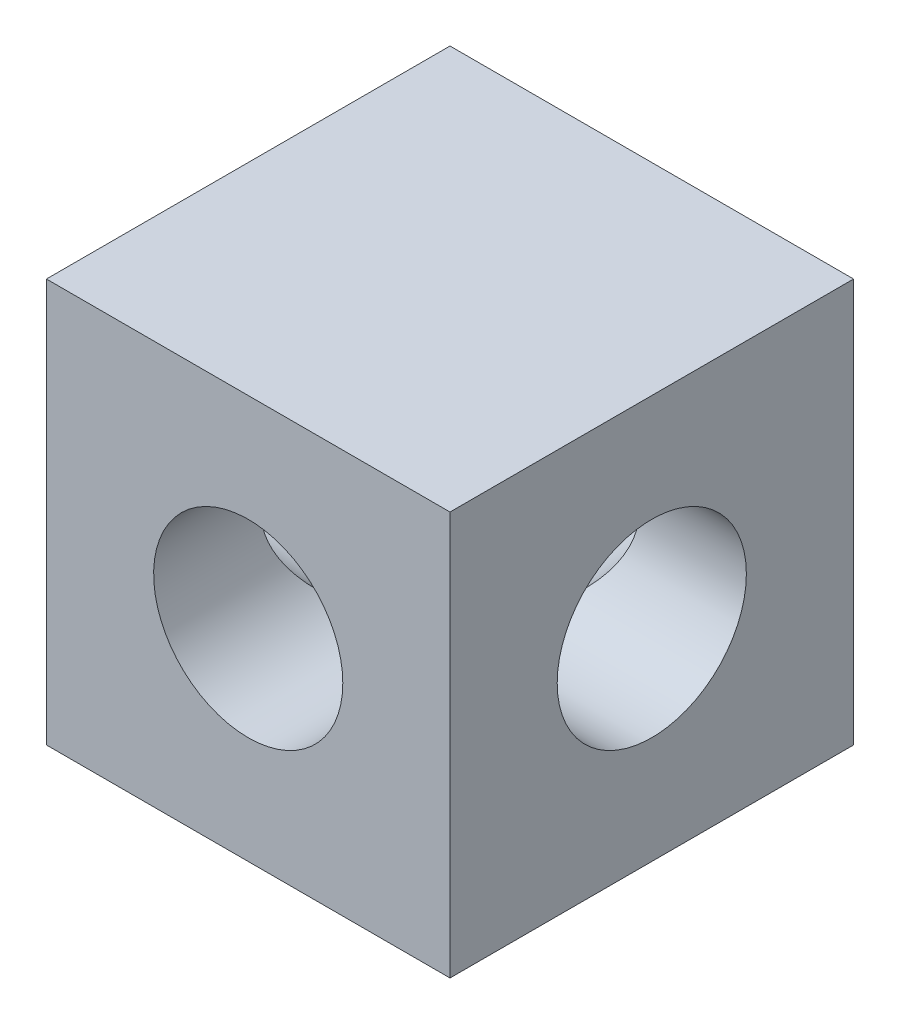
ISO-10303-21;
HEADER;
FILE_DESCRIPTION(('STEP AP214'),'2;1');
FILE_NAME('part.step','',(''),(''),'','','');
FILE_SCHEMA(('AUTOMOTIVE_DESIGN { 1 0 10303 214 1 1 1 1 }'));
ENDSEC;
DATA;
#1=APPLICATION_CONTEXT('core data for automotive mechanical design processes');
#2=APPLICATION_PROTOCOL_DEFINITION('international standard','automotive_design',2000,#1);
#3=PRODUCT_CONTEXT('',#1,'mechanical');
#4=PRODUCT('Part','Part','',(#3));
#5=PRODUCT_RELATED_PRODUCT_CATEGORY('part','',(#4));
#6=PRODUCT_DEFINITION_FORMATION('','',#4);
#7=PRODUCT_DEFINITION_CONTEXT('part definition',#1,'design');
#8=PRODUCT_DEFINITION('design','',#6,#7);
#9=PRODUCT_DEFINITION_SHAPE('','',#8);
#10=(LENGTH_UNIT() NAMED_UNIT(*) SI_UNIT(.MILLI.,.METRE.));
#11=(NAMED_UNIT(*) PLANE_ANGLE_UNIT() SI_UNIT($,.RADIAN.));
#12=(NAMED_UNIT(*) SI_UNIT($,.STERADIAN.) SOLID_ANGLE_UNIT());
#13=UNCERTAINTY_MEASURE_WITH_UNIT(LENGTH_MEASURE(1.E-05),#10,'distance_accuracy_value','');
#14=(GEOMETRIC_REPRESENTATION_CONTEXT(3) GLOBAL_UNCERTAINTY_ASSIGNED_CONTEXT((#13)) GLOBAL_UNIT_ASSIGNED_CONTEXT((#10,
#11,#12)) REPRESENTATION_CONTEXT('',''));
#15=CARTESIAN_POINT('',(0.,0.,0.));
#16=DIRECTION('',(0.,0.,1.));
#17=DIRECTION('',(1.,0.,0.));
#18=AXIS2_PLACEMENT_3D('',#15,#16,#17);
#19=CARTESIAN_POINT('',(0.,0.,10.16));
#20=DIRECTION('',(0.,0.,-1.));
#21=DIRECTION('',(-1.,0.,0.));
#22=AXIS2_PLACEMENT_3D('',#19,#20,#21);
#23=CYLINDRICAL_SURFACE('',#22,4.7625);
#24=CARTESIAN_POINT('',(0.,0.,0.));
#25=DIRECTION('',(0.707106781186547,0.,-0.707106781186547));
#26=DIRECTION('',(-0.707106781186547,0.,-0.707106781186547));
#27=AXIS2_PLACEMENT_3D('',#24,#25,#26);
#28=ELLIPSE('',#27,6.73519209080187,4.7625);
#29=CARTESIAN_POINT('',(0.,-4.7625,0.));
#30=VERTEX_POINT('',#29);
#31=CARTESIAN_POINT('',(0.,4.7625,0.));
#32=VERTEX_POINT('',#31);
#33=EDGE_CURVE('E11',#30,#32,#28,.F.);
#34=ORIENTED_EDGE('',*,*,#33,.F.);
#35=CARTESIAN_POINT('',(0.,0.,0.));
#36=DIRECTION('',(-0.707106781186547,0.,-0.707106781186547));
#37=DIRECTION('',(0.707106781186547,0.,-0.707106781186547));
#38=AXIS2_PLACEMENT_3D('',#35,#36,#37);
#39=ELLIPSE('',#38,6.73519209080187,4.7625);
#40=EDGE_CURVE('E49',#32,#30,#39,.F.);
#41=ORIENTED_EDGE('',*,*,#40,.F.);
#42=EDGE_LOOP('',(#34,#41));
#43=FACE_BOUND('',#42,.T.);
#44=CARTESIAN_POINT('',(0.,0.,10.16));
#45=DIRECTION('',(0.,0.,1.));
#46=DIRECTION('',(1.,0.,0.));
#47=AXIS2_PLACEMENT_3D('',#44,#45,#46);
#48=CIRCLE('',#47,4.7625);
#49=CARTESIAN_POINT('',(4.7625,0.,10.16));
#50=VERTEX_POINT('',#49);
#51=EDGE_CURVE('E126',#50,#50,#48,.T.);
#52=ORIENTED_EDGE('',*,*,#51,.T.);
#53=EDGE_LOOP('',(#52));
#54=FACE_BOUND('',#53,.T.);
#55=ADVANCED_FACE('F35',(#43,#54),#23,.F.);
#56=CARTESIAN_POINT('',(-10.16,10.16,10.16));
#57=DIRECTION('',(0.,0.,1.));
#58=DIRECTION('',(1.,0.,0.));
#59=AXIS2_PLACEMENT_3D('',#56,#57,#58);
#60=PLANE('',#59);
#61=DIRECTION('',(0.,1.,0.));
#62=VECTOR('',#61,1.);
#63=CARTESIAN_POINT('',(-10.16,-10.16,10.16));
#64=LINE('',#63,#62);
#65=CARTESIAN_POINT('',(-10.16,-10.16,10.16));
#66=VERTEX_POINT('',#65);
#67=CARTESIAN_POINT('',(-10.16,10.16,10.16));
#68=VERTEX_POINT('',#67);
#69=EDGE_CURVE('E111',#66,#68,#64,.T.);
#70=ORIENTED_EDGE('',*,*,#69,.F.);
#71=DIRECTION('',(1.,0.,0.));
#72=VECTOR('',#71,1.);
#73=CARTESIAN_POINT('',(-10.16,-10.16,10.16));
#74=LINE('',#73,#72);
#75=CARTESIAN_POINT('',(10.16,-10.16,10.16));
#76=VERTEX_POINT('',#75);
#77=EDGE_CURVE('E100',#66,#76,#74,.T.);
#78=ORIENTED_EDGE('',*,*,#77,.T.);
#79=DIRECTION('',(0.,-1.,0.));
#80=VECTOR('',#79,1.);
#81=CARTESIAN_POINT('',(10.16,10.16,10.16));
#82=LINE('',#81,#80);
#83=CARTESIAN_POINT('',(10.16,10.16,10.16));
#84=VERTEX_POINT('',#83);
#85=EDGE_CURVE('E106',#84,#76,#82,.T.);
#86=ORIENTED_EDGE('',*,*,#85,.F.);
#87=DIRECTION('',(-1.,0.,0.));
#88=VECTOR('',#87,1.);
#89=CARTESIAN_POINT('',(10.16,10.16,10.16));
#90=LINE('',#89,#88);
#91=EDGE_CURVE('E109',#84,#68,#90,.T.);
#92=ORIENTED_EDGE('',*,*,#91,.T.);
#93=EDGE_LOOP('',(#70,#78,#86,#92));
#94=FACE_BOUND('',#93,.T.);
#95=ORIENTED_EDGE('',*,*,#51,.F.);
#96=EDGE_LOOP('',(#95));
#97=FACE_BOUND('',#96,.T.);
#98=ADVANCED_FACE('F158',(#94,#97),#60,.T.);
#99=CARTESIAN_POINT('',(-10.16,10.16,-10.16));
#100=DIRECTION('',(0.,0.,1.));
#101=DIRECTION('',(1.,0.,0.));
#102=AXIS2_PLACEMENT_3D('',#99,#100,#101);
#103=PLANE('',#102);
#104=DIRECTION('',(0.,1.,0.));
#105=VECTOR('',#104,1.);
#106=CARTESIAN_POINT('',(-10.16,-10.16,-10.16));
#107=LINE('',#106,#105);
#108=CARTESIAN_POINT('',(-10.16,-10.16,-10.16));
#109=VERTEX_POINT('',#108);
#110=CARTESIAN_POINT('',(-10.16,10.16,-10.16));
#111=VERTEX_POINT('',#110);
#112=EDGE_CURVE('E123',#109,#111,#107,.T.);
#113=ORIENTED_EDGE('',*,*,#112,.T.);
#114=DIRECTION('',(-1.,0.,0.));
#115=VECTOR('',#114,1.);
#116=CARTESIAN_POINT('',(10.16,10.16,-10.16));
#117=LINE('',#116,#115);
#118=CARTESIAN_POINT('',(10.16,10.16,-10.16));
#119=VERTEX_POINT('',#118);
#120=EDGE_CURVE('E120',#119,#111,#117,.T.);
#121=ORIENTED_EDGE('',*,*,#120,.F.);
#122=DIRECTION('',(0.,-1.,0.));
#123=VECTOR('',#122,1.);
#124=CARTESIAN_POINT('',(10.16,10.16,-10.16));
#125=LINE('',#124,#123);
#126=CARTESIAN_POINT('',(10.16,-10.16,-10.16));
#127=VERTEX_POINT('',#126);
#128=EDGE_CURVE('E117',#119,#127,#125,.T.);
#129=ORIENTED_EDGE('',*,*,#128,.T.);
#130=DIRECTION('',(1.,0.,0.));
#131=VECTOR('',#130,1.);
#132=CARTESIAN_POINT('',(-10.16,-10.16,-10.16));
#133=LINE('',#132,#131);
#134=EDGE_CURVE('E114',#109,#127,#133,.T.);
#135=ORIENTED_EDGE('',*,*,#134,.F.);
#136=EDGE_LOOP('',(#113,#121,#129,#135));
#137=FACE_BOUND('',#136,.T.);
#138=CARTESIAN_POINT('',(0.,0.,-10.16));
#139=DIRECTION('',(0.,0.,1.));
#140=DIRECTION('',(1.,0.,0.));
#141=AXIS2_PLACEMENT_3D('',#138,#139,#140);
#142=CIRCLE('',#141,4.7625);
#143=CARTESIAN_POINT('',(4.7625,0.,-10.16));
#144=VERTEX_POINT('',#143);
#145=EDGE_CURVE('E129',#144,#144,#142,.T.);
#146=ORIENTED_EDGE('',*,*,#145,.T.);
#147=EDGE_LOOP('',(#146));
#148=FACE_BOUND('',#147,.T.);
#149=ADVANCED_FACE('F151',(#137,#148),#103,.F.);
#150=CARTESIAN_POINT('',(-10.16,-10.16,10.16));
#151=DIRECTION('',(-1.,0.,0.));
#152=DIRECTION('',(0.,-1.,0.));
#153=AXIS2_PLACEMENT_3D('',#150,#151,#152);
#154=PLANE('',#153);
#155=CARTESIAN_POINT('',(-10.16,0.,0.));
#156=DIRECTION('',(1.,0.,0.));
#157=DIRECTION('',(0.,0.,-1.));
#158=AXIS2_PLACEMENT_3D('',#155,#156,#157);
#159=CIRCLE('',#158,4.7625);
#160=CARTESIAN_POINT('',(-10.16,0.,-4.7625));
#161=VERTEX_POINT('',#160);
#162=EDGE_CURVE('E132',#161,#161,#159,.T.);
#163=ORIENTED_EDGE('',*,*,#162,.T.);
#164=EDGE_LOOP('',(#163));
#165=FACE_BOUND('',#164,.T.);
#166=ORIENTED_EDGE('',*,*,#112,.F.);
#167=DIRECTION('',(0.,0.,-1.));
#168=VECTOR('',#167,1.);
#169=CARTESIAN_POINT('',(-10.16,-10.16,10.16));
#170=LINE('',#169,#168);
#171=EDGE_CURVE('E57',#66,#109,#170,.T.);
#172=ORIENTED_EDGE('',*,*,#171,.F.);
#173=ORIENTED_EDGE('',*,*,#69,.T.);
#174=DIRECTION('',(0.,0.,-1.));
#175=VECTOR('',#174,1.);
#176=CARTESIAN_POINT('',(-10.16,10.16,10.16));
#177=LINE('',#176,#175);
#178=EDGE_CURVE('E97',#68,#111,#177,.T.);
#179=ORIENTED_EDGE('',*,*,#178,.T.);
#180=EDGE_LOOP('',(#166,#172,#173,#179));
#181=FACE_BOUND('',#180,.T.);
#182=ADVANCED_FACE('F37',(#165,#181),#154,.T.);
#183=CARTESIAN_POINT('',(-10.16,-10.16,10.16));
#184=DIRECTION('',(0.,1.,0.));
#185=DIRECTION('',(0.,0.,1.));
#186=AXIS2_PLACEMENT_3D('',#183,#184,#185);
#187=PLANE('',#186);
#188=ORIENTED_EDGE('',*,*,#134,.T.);
#189=DIRECTION('',(0.,0.,-1.));
#190=VECTOR('',#189,1.);
#191=CARTESIAN_POINT('',(10.16,-10.16,10.16));
#192=LINE('',#191,#190);
#193=EDGE_CURVE('E102',#76,#127,#192,.T.);
#194=ORIENTED_EDGE('',*,*,#193,.F.);
#195=ORIENTED_EDGE('',*,*,#77,.F.);
#196=ORIENTED_EDGE('',*,*,#171,.T.);
#197=EDGE_LOOP('',(#188,#194,#195,#196));
#198=FACE_BOUND('',#197,.T.);
#199=ADVANCED_FACE('F143',(#198),#187,.F.);
#200=CARTESIAN_POINT('',(10.16,10.16,10.16));
#201=DIRECTION('',(1.,0.,0.));
#202=DIRECTION('',(0.,0.,-1.));
#203=AXIS2_PLACEMENT_3D('',#200,#201,#202);
#204=PLANE('',#203);
#205=CARTESIAN_POINT('',(10.16,0.,0.));
#206=DIRECTION('',(1.,0.,0.));
#207=DIRECTION('',(0.,0.,-1.));
#208=AXIS2_PLACEMENT_3D('',#205,#206,#207);
#209=CIRCLE('',#208,4.7625);
#210=CARTESIAN_POINT('',(10.16,0.,-4.7625));
#211=VERTEX_POINT('',#210);
#212=EDGE_CURVE('E135',#211,#211,#209,.T.);
#213=ORIENTED_EDGE('',*,*,#212,.F.);
#214=EDGE_LOOP('',(#213));
#215=FACE_BOUND('',#214,.T.);
#216=ORIENTED_EDGE('',*,*,#128,.F.);
#217=DIRECTION('',(0.,0.,-1.));
#218=VECTOR('',#217,1.);
#219=CARTESIAN_POINT('',(10.16,10.16,10.16));
#220=LINE('',#219,#218);
#221=EDGE_CURVE('E99',#84,#119,#220,.T.);
#222=ORIENTED_EDGE('',*,*,#221,.F.);
#223=ORIENTED_EDGE('',*,*,#85,.T.);
#224=ORIENTED_EDGE('',*,*,#193,.T.);
#225=EDGE_LOOP('',(#216,#222,#223,#224));
#226=FACE_BOUND('',#225,.T.);
#227=ADVANCED_FACE('F139',(#215,#226),#204,.T.);
#228=CARTESIAN_POINT('',(10.16,10.16,10.16));
#229=DIRECTION('',(0.,-1.,0.));
#230=DIRECTION('',(0.,0.,-1.));
#231=AXIS2_PLACEMENT_3D('',#228,#229,#230);
#232=PLANE('',#231);
#233=ORIENTED_EDGE('',*,*,#120,.T.);
#234=ORIENTED_EDGE('',*,*,#178,.F.);
#235=ORIENTED_EDGE('',*,*,#91,.F.);
#236=ORIENTED_EDGE('',*,*,#221,.T.);
#237=EDGE_LOOP('',(#233,#234,#235,#236));
#238=FACE_BOUND('',#237,.T.);
#239=ADVANCED_FACE('F142',(#238),#232,.F.);
#240=CARTESIAN_POINT('',(0.,0.,0.));
#241=DIRECTION('',(0.707106781186547,0.,-0.707106781186547));
#242=DIRECTION('',(-0.707106781186547,0.,-0.707106781186547));
#243=AXIS2_PLACEMENT_3D('',#240,#241,#242);
#244=ELLIPSE('',#243,6.73519209080187,4.7625);
#245=EDGE_CURVE('E43',#30,#32,#244,.T.);
#246=ORIENTED_EDGE('',*,*,#245,.F.);
#247=CARTESIAN_POINT('',(0.,0.,0.));
#248=DIRECTION('',(-0.707106781186547,0.,-0.707106781186547));
#249=DIRECTION('',(0.707106781186547,0.,-0.707106781186547));
#250=AXIS2_PLACEMENT_3D('',#247,#248,#249);
#251=ELLIPSE('',#250,6.73519209080187,4.7625);
#252=EDGE_CURVE('E83',#32,#30,#251,.T.);
#253=ORIENTED_EDGE('',*,*,#252,.F.);
#254=EDGE_LOOP('',(#246,#253));
#255=FACE_BOUND('',#254,.T.);
#256=ORIENTED_EDGE('',*,*,#145,.F.);
#257=EDGE_LOOP('',(#256));
#258=FACE_BOUND('',#257,.T.);
#259=ADVANCED_FACE('F94',(#255,#258),#23,.F.);
#260=CARTESIAN_POINT('',(-10.16,0.,0.));
#261=DIRECTION('',(1.,0.,0.));
#262=DIRECTION('',(0.,0.,-1.));
#263=AXIS2_PLACEMENT_3D('',#260,#261,#262);
#264=CYLINDRICAL_SURFACE('',#263,4.7625);
#265=ORIENTED_EDGE('',*,*,#245,.T.);
#266=ORIENTED_EDGE('',*,*,#40,.T.);
#267=EDGE_LOOP('',(#265,#266));
#268=FACE_BOUND('',#267,.T.);
#269=ORIENTED_EDGE('',*,*,#162,.F.);
#270=EDGE_LOOP('',(#269));
#271=FACE_BOUND('',#270,.T.);
#272=ADVANCED_FACE('F90',(#268,#271),#264,.F.);
#273=ORIENTED_EDGE('',*,*,#33,.T.);
#274=ORIENTED_EDGE('',*,*,#252,.T.);
#275=EDGE_LOOP('',(#273,#274));
#276=FACE_BOUND('',#275,.T.);
#277=ORIENTED_EDGE('',*,*,#212,.T.);
#278=EDGE_LOOP('',(#277));
#279=FACE_BOUND('',#278,.T.);
#280=ADVANCED_FACE('F84',(#276,#279),#264,.F.);
#281=CLOSED_SHELL('',(#55,#98,#149,#182,#199,#227,#239,#259,#272,#280));
#282=MANIFOLD_SOLID_BREP('B2',#281);
#283=ADVANCED_BREP_SHAPE_REPRESENTATION('',(#18,#282),#14);
#284=SHAPE_DEFINITION_REPRESENTATION(#9,#283);
ENDSEC;
END-ISO-10303-21;
